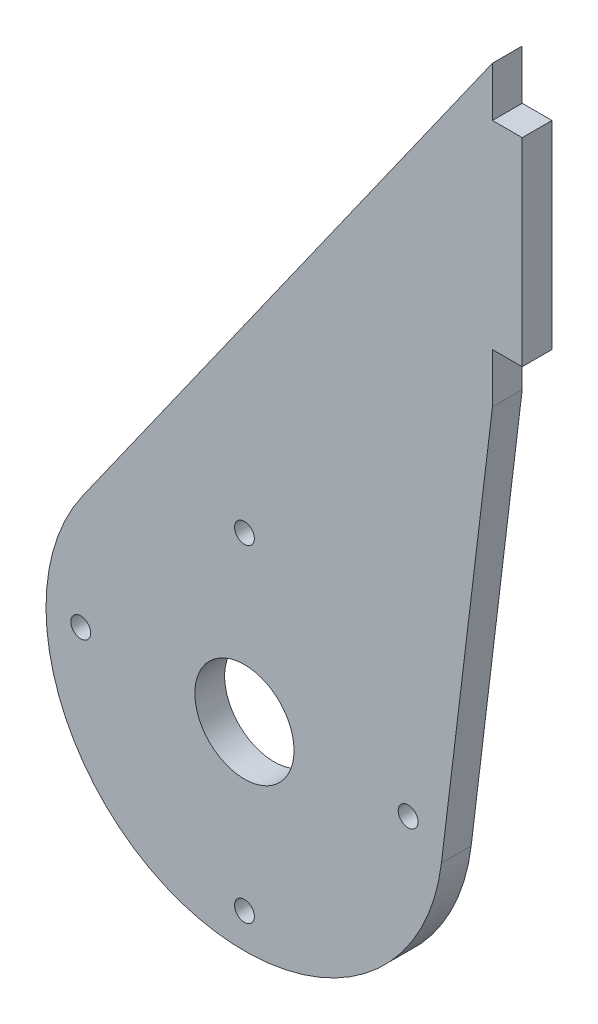
ISO-10303-21;
HEADER;
FILE_DESCRIPTION(('STEP AP214'),'2;1');
FILE_NAME('part.step','',(''),(''),'','','');
FILE_SCHEMA(('AUTOMOTIVE_DESIGN { 1 0 10303 214 1 1 1 1 }'));
ENDSEC;
DATA;
#1=APPLICATION_CONTEXT('core data for automotive mechanical design processes');
#2=APPLICATION_PROTOCOL_DEFINITION('international standard','automotive_design',2000,#1);
#3=PRODUCT_CONTEXT('',#1,'mechanical');
#4=PRODUCT('Part','Part','',(#3));
#5=PRODUCT_RELATED_PRODUCT_CATEGORY('part','',(#4));
#6=PRODUCT_DEFINITION_FORMATION('','',#4);
#7=PRODUCT_DEFINITION_CONTEXT('part definition',#1,'design');
#8=PRODUCT_DEFINITION('design','',#6,#7);
#9=PRODUCT_DEFINITION_SHAPE('','',#8);
#10=(LENGTH_UNIT() NAMED_UNIT(*) SI_UNIT(.MILLI.,.METRE.));
#11=(NAMED_UNIT(*) PLANE_ANGLE_UNIT() SI_UNIT($,.RADIAN.));
#12=(NAMED_UNIT(*) SI_UNIT($,.STERADIAN.) SOLID_ANGLE_UNIT());
#13=UNCERTAINTY_MEASURE_WITH_UNIT(LENGTH_MEASURE(1.E-05),#10,'distance_accuracy_value','');
#14=(GEOMETRIC_REPRESENTATION_CONTEXT(3) GLOBAL_UNCERTAINTY_ASSIGNED_CONTEXT((#13)) GLOBAL_UNIT_ASSIGNED_CONTEXT((#10,
#11,#12)) REPRESENTATION_CONTEXT('',''));
#15=CARTESIAN_POINT('',(0.,0.,0.));
#16=DIRECTION('',(0.,0.,1.));
#17=DIRECTION('',(1.,0.,0.));
#18=AXIS2_PLACEMENT_3D('',#15,#16,#17);
#19=CARTESIAN_POINT('',(25.,70.,-3.));
#20=DIRECTION('',(1.,0.,0.));
#21=DIRECTION('',(0.,1.,0.));
#22=AXIS2_PLACEMENT_3D('',#19,#20,#21);
#23=PLANE('',#22);
#24=DIRECTION('',(0.,0.,1.));
#25=VECTOR('',#24,1.);
#26=CARTESIAN_POINT('',(25.,65.,0.));
#27=LINE('',#26,#25);
#28=CARTESIAN_POINT('',(25.,65.,-3.));
#29=VERTEX_POINT('',#28);
#30=CARTESIAN_POINT('',(25.,65.,0.));
#31=VERTEX_POINT('',#30);
#32=EDGE_CURVE('E49',#29,#31,#27,.T.);
#33=ORIENTED_EDGE('',*,*,#32,.F.);
#34=DIRECTION('',(0.,1.,0.));
#35=VECTOR('',#34,1.);
#36=CARTESIAN_POINT('',(25.,70.,-3.));
#37=LINE('',#36,#35);
#38=CARTESIAN_POINT('',(25.,70.,-3.));
#39=VERTEX_POINT('',#38);
#40=EDGE_CURVE('E155',#29,#39,#37,.T.);
#41=ORIENTED_EDGE('',*,*,#40,.T.);
#42=DIRECTION('',(0.,0.,1.));
#43=VECTOR('',#42,1.);
#44=CARTESIAN_POINT('',(25.,70.,-3.));
#45=LINE('',#44,#43);
#46=CARTESIAN_POINT('',(25.,70.,0.));
#47=VERTEX_POINT('',#46);
#48=EDGE_CURVE('E41',#39,#47,#45,.T.);
#49=ORIENTED_EDGE('',*,*,#48,.T.);
#50=DIRECTION('',(0.,1.,0.));
#51=VECTOR('',#50,1.);
#52=CARTESIAN_POINT('',(25.,70.,0.));
#53=LINE('',#52,#51);
#54=EDGE_CURVE('E54',#31,#47,#53,.T.);
#55=ORIENTED_EDGE('',*,*,#54,.F.);
#56=EDGE_LOOP('',(#33,#41,#49,#55));
#57=FACE_BOUND('',#56,.T.);
#58=ADVANCED_FACE('F32',(#57),#23,.T.);
#59=CARTESIAN_POINT('',(0.,0.,-3.));
#60=DIRECTION('',(0.,0.,1.));
#61=DIRECTION('',(1.,0.,0.));
#62=AXIS2_PLACEMENT_3D('',#59,#60,#61);
#63=CYLINDRICAL_SURFACE('',#62,20.);
#64=CARTESIAN_POINT('',(0.,0.,0.));
#65=DIRECTION('',(0.,0.,1.));
#66=DIRECTION('',(1.,0.,0.));
#67=AXIS2_PLACEMENT_3D('',#64,#65,#66);
#68=CIRCLE('',#67,20.);
#69=CARTESIAN_POINT('',(-16.3302710303954,11.5465253679983,0.));
#70=VERTEX_POINT('',#69);
#71=CARTESIAN_POINT('',(19.854388755627,-2.40899297226689,0.));
#72=VERTEX_POINT('',#71);
#73=EDGE_CURVE('E147',#70,#72,#68,.T.);
#74=ORIENTED_EDGE('',*,*,#73,.F.);
#75=DIRECTION('',(0.,0.,1.));
#76=VECTOR('',#75,1.);
#77=CARTESIAN_POINT('',(-16.3302710303954,11.5465253679983,-3.));
#78=LINE('',#77,#76);
#79=CARTESIAN_POINT('',(-16.3302710303954,11.5465253679983,-3.));
#80=VERTEX_POINT('',#79);
#81=EDGE_CURVE('E11',#80,#70,#78,.T.);
#82=ORIENTED_EDGE('',*,*,#81,.F.);
#83=CARTESIAN_POINT('',(0.,0.,-3.));
#84=DIRECTION('',(0.,0.,1.));
#85=DIRECTION('',(1.,0.,0.));
#86=AXIS2_PLACEMENT_3D('',#83,#84,#85);
#87=CIRCLE('',#86,20.);
#88=CARTESIAN_POINT('',(19.854388755627,-2.40899297226689,-3.));
#89=VERTEX_POINT('',#88);
#90=EDGE_CURVE('E148',#80,#89,#87,.T.);
#91=ORIENTED_EDGE('',*,*,#90,.T.);
#92=DIRECTION('',(0.,0.,1.));
#93=VECTOR('',#92,1.);
#94=CARTESIAN_POINT('',(19.854388755627,-2.40899297226689,-3.));
#95=LINE('',#94,#93);
#96=EDGE_CURVE('E178',#89,#72,#95,.T.);
#97=ORIENTED_EDGE('',*,*,#96,.T.);
#98=EDGE_LOOP('',(#74,#82,#91,#97));
#99=FACE_BOUND('',#98,.T.);
#100=ADVANCED_FACE('F34',(#99),#63,.T.);
#101=CARTESIAN_POINT('',(-16.3302710303954,11.5465253679983,-3.));
#102=DIRECTION('',(-0.816513551519769,0.577326268399917,0.));
#103=DIRECTION('',(-0.577326268399917,-0.816513551519769,0.));
#104=AXIS2_PLACEMENT_3D('',#101,#102,#103);
#105=PLANE('',#104);
#106=DIRECTION('',(-0.577326268399917,-0.816513551519769,0.));
#107=VECTOR('',#106,1.);
#108=CARTESIAN_POINT('',(-16.3302710303954,11.5465253679983,0.));
#109=LINE('',#108,#107);
#110=EDGE_CURVE('E152',#47,#70,#109,.T.);
#111=ORIENTED_EDGE('',*,*,#110,.F.);
#112=ORIENTED_EDGE('',*,*,#48,.F.);
#113=DIRECTION('',(-0.577326268399917,-0.816513551519769,0.));
#114=VECTOR('',#113,1.);
#115=CARTESIAN_POINT('',(-16.3302710303954,11.5465253679983,-3.));
#116=LINE('',#115,#114);
#117=EDGE_CURVE('E158',#39,#80,#116,.T.);
#118=ORIENTED_EDGE('',*,*,#117,.T.);
#119=ORIENTED_EDGE('',*,*,#81,.T.);
#120=EDGE_LOOP('',(#111,#112,#118,#119));
#121=FACE_BOUND('',#120,.T.);
#122=ADVANCED_FACE('F187',(#121),#105,.T.);
#123=DIRECTION('',(0.,0.,-1.));
#124=VECTOR('',#123,1.);
#125=CARTESIAN_POINT('',(25.,45.,0.));
#126=LINE('',#125,#124);
#127=CARTESIAN_POINT('',(25.,45.,0.));
#128=VERTEX_POINT('',#127);
#129=CARTESIAN_POINT('',(25.,45.,-3.));
#130=VERTEX_POINT('',#129);
#131=EDGE_CURVE('E137',#128,#130,#126,.T.);
#132=ORIENTED_EDGE('',*,*,#131,.F.);
#133=CARTESIAN_POINT('',(25.,40.,0.));
#134=VERTEX_POINT('',#133);
#135=EDGE_CURVE('E122',#134,#128,#53,.T.);
#136=ORIENTED_EDGE('',*,*,#135,.F.);
#137=DIRECTION('',(0.,0.,1.));
#138=VECTOR('',#137,1.);
#139=CARTESIAN_POINT('',(25.,40.,-3.));
#140=LINE('',#139,#138);
#141=CARTESIAN_POINT('',(25.,40.,-3.));
#142=VERTEX_POINT('',#141);
#143=EDGE_CURVE('E177',#142,#134,#140,.T.);
#144=ORIENTED_EDGE('',*,*,#143,.F.);
#145=EDGE_CURVE('E164',#142,#130,#37,.T.);
#146=ORIENTED_EDGE('',*,*,#145,.T.);
#147=EDGE_LOOP('',(#132,#136,#144,#146));
#148=FACE_BOUND('',#147,.T.);
#149=ADVANCED_FACE('F197',(#148),#23,.T.);
#150=CARTESIAN_POINT('',(25.,40.,-3.));
#151=DIRECTION('',(0.992719437781351,-0.120449648613344,0.));
#152=DIRECTION('',(0.120449648613344,0.992719437781351,0.));
#153=AXIS2_PLACEMENT_3D('',#150,#151,#152);
#154=PLANE('',#153);
#155=DIRECTION('',(0.120449648613344,0.992719437781351,0.));
#156=VECTOR('',#155,1.);
#157=CARTESIAN_POINT('',(25.,40.,0.));
#158=LINE('',#157,#156);
#159=EDGE_CURVE('E168',#72,#134,#158,.T.);
#160=ORIENTED_EDGE('',*,*,#159,.F.);
#161=ORIENTED_EDGE('',*,*,#96,.F.);
#162=DIRECTION('',(0.120449648613344,0.992719437781351,0.));
#163=VECTOR('',#162,1.);
#164=CARTESIAN_POINT('',(25.,40.,-3.));
#165=LINE('',#164,#163);
#166=EDGE_CURVE('E151',#89,#142,#165,.T.);
#167=ORIENTED_EDGE('',*,*,#166,.T.);
#168=ORIENTED_EDGE('',*,*,#143,.T.);
#169=EDGE_LOOP('',(#160,#161,#167,#168));
#170=FACE_BOUND('',#169,.T.);
#171=ADVANCED_FACE('F203',(#170),#154,.T.);
#172=CARTESIAN_POINT('',(0.,0.,-3.));
#173=DIRECTION('',(0.,0.,1.));
#174=DIRECTION('',(1.,0.,0.));
#175=AXIS2_PLACEMENT_3D('',#172,#173,#174);
#176=PLANE('',#175);
#177=CARTESIAN_POINT('',(-16.5,0.,-3.));
#178=DIRECTION('',(0.,0.,1.));
#179=DIRECTION('',(1.,0.,0.));
#180=AXIS2_PLACEMENT_3D('',#177,#178,#179);
#181=CIRCLE('',#180,1.);
#182=CARTESIAN_POINT('',(-15.5,0.,-3.));
#183=VERTEX_POINT('',#182);
#184=EDGE_CURVE('E286',#183,#183,#181,.T.);
#185=ORIENTED_EDGE('',*,*,#184,.T.);
#186=EDGE_LOOP('',(#185));
#187=FACE_BOUND('',#186,.T.);
#188=CARTESIAN_POINT('',(16.5,0.,-3.));
#189=DIRECTION('',(0.,0.,1.));
#190=DIRECTION('',(1.,0.,0.));
#191=AXIS2_PLACEMENT_3D('',#188,#189,#190);
#192=CIRCLE('',#191,1.);
#193=CARTESIAN_POINT('',(17.5,0.,-3.));
#194=VERTEX_POINT('',#193);
#195=EDGE_CURVE('E288',#194,#194,#192,.T.);
#196=ORIENTED_EDGE('',*,*,#195,.T.);
#197=EDGE_LOOP('',(#196));
#198=FACE_BOUND('',#197,.T.);
#199=CARTESIAN_POINT('',(0.,-16.5,-3.));
#200=DIRECTION('',(0.,0.,1.));
#201=DIRECTION('',(1.,0.,0.));
#202=AXIS2_PLACEMENT_3D('',#199,#200,#201);
#203=CIRCLE('',#202,1.);
#204=CARTESIAN_POINT('',(1.,-16.5,-3.));
#205=VERTEX_POINT('',#204);
#206=EDGE_CURVE('E217',#205,#205,#203,.T.);
#207=ORIENTED_EDGE('',*,*,#206,.T.);
#208=EDGE_LOOP('',(#207));
#209=FACE_BOUND('',#208,.T.);
#210=CARTESIAN_POINT('',(0.,16.5,-3.));
#211=DIRECTION('',(0.,0.,1.));
#212=DIRECTION('',(1.,0.,0.));
#213=AXIS2_PLACEMENT_3D('',#210,#211,#212);
#214=CIRCLE('',#213,1.);
#215=CARTESIAN_POINT('',(1.,16.5,-3.));
#216=VERTEX_POINT('',#215);
#217=EDGE_CURVE('E210',#216,#216,#214,.T.);
#218=ORIENTED_EDGE('',*,*,#217,.T.);
#219=EDGE_LOOP('',(#218));
#220=FACE_BOUND('',#219,.T.);
#221=CARTESIAN_POINT('',(0.,0.,-3.));
#222=DIRECTION('',(0.,0.,1.));
#223=DIRECTION('',(1.,0.,0.));
#224=AXIS2_PLACEMENT_3D('',#221,#222,#223);
#225=CIRCLE('',#224,5.);
#226=CARTESIAN_POINT('',(5.,0.,-3.));
#227=VERTEX_POINT('',#226);
#228=EDGE_CURVE('E126',#227,#227,#225,.T.);
#229=ORIENTED_EDGE('',*,*,#228,.T.);
#230=EDGE_LOOP('',(#229));
#231=FACE_BOUND('',#230,.T.);
#232=ORIENTED_EDGE('',*,*,#90,.F.);
#233=ORIENTED_EDGE('',*,*,#117,.F.);
#234=ORIENTED_EDGE('',*,*,#40,.F.);
#235=DIRECTION('',(-1.,0.,0.));
#236=VECTOR('',#235,1.);
#237=CARTESIAN_POINT('',(28.,65.,-3.));
#238=LINE('',#237,#236);
#239=CARTESIAN_POINT('',(28.,65.,-3.));
#240=VERTEX_POINT('',#239);
#241=EDGE_CURVE('E128',#240,#29,#238,.T.);
#242=ORIENTED_EDGE('',*,*,#241,.F.);
#243=DIRECTION('',(0.,1.,0.));
#244=VECTOR('',#243,1.);
#245=CARTESIAN_POINT('',(28.,65.,-3.));
#246=LINE('',#245,#244);
#247=CARTESIAN_POINT('',(28.,45.,-3.));
#248=VERTEX_POINT('',#247);
#249=EDGE_CURVE('E106',#248,#240,#246,.T.);
#250=ORIENTED_EDGE('',*,*,#249,.F.);
#251=DIRECTION('',(-1.,0.,0.));
#252=VECTOR('',#251,1.);
#253=CARTESIAN_POINT('',(28.,45.,-3.));
#254=LINE('',#253,#252);
#255=EDGE_CURVE('E103',#248,#130,#254,.T.);
#256=ORIENTED_EDGE('',*,*,#255,.T.);
#257=ORIENTED_EDGE('',*,*,#145,.F.);
#258=ORIENTED_EDGE('',*,*,#166,.F.);
#259=EDGE_LOOP('',(#232,#233,#234,#242,#250,#256,#257,#258));
#260=FACE_BOUND('',#259,.T.);
#261=ADVANCED_FACE('F190',(#187,#198,#209,#220,#231,#260),#176,.F.);
#262=CARTESIAN_POINT('',(0.,0.,0.));
#263=DIRECTION('',(0.,0.,1.));
#264=DIRECTION('',(1.,0.,0.));
#265=AXIS2_PLACEMENT_3D('',#262,#263,#264);
#266=PLANE('',#265);
#267=CARTESIAN_POINT('',(-16.5,0.,0.));
#268=DIRECTION('',(0.,0.,1.));
#269=DIRECTION('',(1.,0.,0.));
#270=AXIS2_PLACEMENT_3D('',#267,#268,#269);
#271=CIRCLE('',#270,1.);
#272=CARTESIAN_POINT('',(-15.5,0.,0.));
#273=VERTEX_POINT('',#272);
#274=EDGE_CURVE('E249',#273,#273,#271,.T.);
#275=ORIENTED_EDGE('',*,*,#274,.F.);
#276=EDGE_LOOP('',(#275));
#277=FACE_BOUND('',#276,.T.);
#278=CARTESIAN_POINT('',(16.5,0.,0.));
#279=DIRECTION('',(0.,0.,1.));
#280=DIRECTION('',(1.,0.,0.));
#281=AXIS2_PLACEMENT_3D('',#278,#279,#280);
#282=CIRCLE('',#281,1.);
#283=CARTESIAN_POINT('',(17.5,0.,0.));
#284=VERTEX_POINT('',#283);
#285=EDGE_CURVE('E253',#284,#284,#282,.T.);
#286=ORIENTED_EDGE('',*,*,#285,.F.);
#287=EDGE_LOOP('',(#286));
#288=FACE_BOUND('',#287,.T.);
#289=CARTESIAN_POINT('',(0.,-16.5,0.));
#290=DIRECTION('',(0.,0.,1.));
#291=DIRECTION('',(1.,0.,0.));
#292=AXIS2_PLACEMENT_3D('',#289,#290,#291);
#293=CIRCLE('',#292,1.);
#294=CARTESIAN_POINT('',(1.,-16.5,0.));
#295=VERTEX_POINT('',#294);
#296=EDGE_CURVE('E257',#295,#295,#293,.T.);
#297=ORIENTED_EDGE('',*,*,#296,.F.);
#298=EDGE_LOOP('',(#297));
#299=FACE_BOUND('',#298,.T.);
#300=CARTESIAN_POINT('',(0.,16.5,0.));
#301=DIRECTION('',(0.,0.,1.));
#302=DIRECTION('',(1.,0.,0.));
#303=AXIS2_PLACEMENT_3D('',#300,#301,#302);
#304=CIRCLE('',#303,1.);
#305=CARTESIAN_POINT('',(1.,16.5,0.));
#306=VERTEX_POINT('',#305);
#307=EDGE_CURVE('E212',#306,#306,#304,.T.);
#308=ORIENTED_EDGE('',*,*,#307,.F.);
#309=EDGE_LOOP('',(#308));
#310=FACE_BOUND('',#309,.T.);
#311=CARTESIAN_POINT('',(0.,0.,0.));
#312=DIRECTION('',(0.,0.,1.));
#313=DIRECTION('',(1.,0.,0.));
#314=AXIS2_PLACEMENT_3D('',#311,#312,#313);
#315=CIRCLE('',#314,5.);
#316=CARTESIAN_POINT('',(5.,0.,0.));
#317=VERTEX_POINT('',#316);
#318=EDGE_CURVE('E123',#317,#317,#315,.T.);
#319=ORIENTED_EDGE('',*,*,#318,.F.);
#320=EDGE_LOOP('',(#319));
#321=FACE_BOUND('',#320,.T.);
#322=ORIENTED_EDGE('',*,*,#73,.T.);
#323=ORIENTED_EDGE('',*,*,#159,.T.);
#324=ORIENTED_EDGE('',*,*,#135,.T.);
#325=DIRECTION('',(-1.,0.,0.));
#326=VECTOR('',#325,1.);
#327=CARTESIAN_POINT('',(28.,45.,0.));
#328=LINE('',#327,#326);
#329=CARTESIAN_POINT('',(28.,45.,0.));
#330=VERTEX_POINT('',#329);
#331=EDGE_CURVE('E101',#330,#128,#328,.T.);
#332=ORIENTED_EDGE('',*,*,#331,.F.);
#333=DIRECTION('',(0.,-1.,0.));
#334=VECTOR('',#333,1.);
#335=CARTESIAN_POINT('',(28.,65.,0.));
#336=LINE('',#335,#334);
#337=CARTESIAN_POINT('',(28.,65.,0.));
#338=VERTEX_POINT('',#337);
#339=EDGE_CURVE('E107',#338,#330,#336,.T.);
#340=ORIENTED_EDGE('',*,*,#339,.F.);
#341=DIRECTION('',(-1.,0.,0.));
#342=VECTOR('',#341,1.);
#343=CARTESIAN_POINT('',(28.,65.,0.));
#344=LINE('',#343,#342);
#345=EDGE_CURVE('E138',#338,#31,#344,.T.);
#346=ORIENTED_EDGE('',*,*,#345,.T.);
#347=ORIENTED_EDGE('',*,*,#54,.T.);
#348=ORIENTED_EDGE('',*,*,#110,.T.);
#349=EDGE_LOOP('',(#322,#323,#324,#332,#340,#346,#347,#348));
#350=FACE_BOUND('',#349,.T.);
#351=ADVANCED_FACE('F119',(#277,#288,#299,#310,#321,#350),#266,.T.);
#352=CARTESIAN_POINT('',(0.,0.,-10.));
#353=DIRECTION('',(0.,0.,1.));
#354=DIRECTION('',(1.,0.,0.));
#355=AXIS2_PLACEMENT_3D('',#352,#353,#354);
#356=CYLINDRICAL_SURFACE('',#355,5.);
#357=ORIENTED_EDGE('',*,*,#318,.T.);
#358=EDGE_LOOP('',(#357));
#359=FACE_BOUND('',#358,.T.);
#360=ORIENTED_EDGE('',*,*,#228,.F.);
#361=EDGE_LOOP('',(#360));
#362=FACE_BOUND('',#361,.T.);
#363=ADVANCED_FACE('F232',(#359,#362),#356,.F.);
#364=CARTESIAN_POINT('',(28.,45.,0.));
#365=DIRECTION('',(0.,1.,0.));
#366=DIRECTION('',(-1.,0.,0.));
#367=AXIS2_PLACEMENT_3D('',#364,#365,#366);
#368=PLANE('',#367);
#369=ORIENTED_EDGE('',*,*,#131,.T.);
#370=ORIENTED_EDGE('',*,*,#255,.F.);
#371=DIRECTION('',(0.,0.,-1.));
#372=VECTOR('',#371,1.);
#373=CARTESIAN_POINT('',(28.,45.,0.));
#374=LINE('',#373,#372);
#375=EDGE_CURVE('E96',#330,#248,#374,.T.);
#376=ORIENTED_EDGE('',*,*,#375,.F.);
#377=ORIENTED_EDGE('',*,*,#331,.T.);
#378=EDGE_LOOP('',(#369,#370,#376,#377));
#379=FACE_BOUND('',#378,.T.);
#380=ADVANCED_FACE('F99',(#379),#368,.F.);
#381=CARTESIAN_POINT('',(28.,65.,0.));
#382=DIRECTION('',(0.,-1.,0.));
#383=DIRECTION('',(1.,0.,0.));
#384=AXIS2_PLACEMENT_3D('',#381,#382,#383);
#385=PLANE('',#384);
#386=ORIENTED_EDGE('',*,*,#32,.T.);
#387=ORIENTED_EDGE('',*,*,#345,.F.);
#388=DIRECTION('',(0.,0.,1.));
#389=VECTOR('',#388,1.);
#390=CARTESIAN_POINT('',(28.,65.,0.));
#391=LINE('',#390,#389);
#392=EDGE_CURVE('E112',#240,#338,#391,.T.);
#393=ORIENTED_EDGE('',*,*,#392,.F.);
#394=ORIENTED_EDGE('',*,*,#241,.T.);
#395=EDGE_LOOP('',(#386,#387,#393,#394));
#396=FACE_BOUND('',#395,.T.);
#397=ADVANCED_FACE('F223',(#396),#385,.F.);
#398=CARTESIAN_POINT('',(28.,0.,0.));
#399=DIRECTION('',(1.,0.,0.));
#400=DIRECTION('',(0.,1.,0.));
#401=AXIS2_PLACEMENT_3D('',#398,#399,#400);
#402=PLANE('',#401);
#403=ORIENTED_EDGE('',*,*,#339,.T.);
#404=ORIENTED_EDGE('',*,*,#375,.T.);
#405=ORIENTED_EDGE('',*,*,#249,.T.);
#406=ORIENTED_EDGE('',*,*,#392,.T.);
#407=EDGE_LOOP('',(#403,#404,#405,#406));
#408=FACE_BOUND('',#407,.T.);
#409=ADVANCED_FACE('F110',(#408),#402,.T.);
#410=CARTESIAN_POINT('',(0.,16.5,-10.));
#411=DIRECTION('',(0.,0.,1.));
#412=DIRECTION('',(1.,0.,0.));
#413=AXIS2_PLACEMENT_3D('',#410,#411,#412);
#414=CYLINDRICAL_SURFACE('',#413,1.);
#415=ORIENTED_EDGE('',*,*,#307,.T.);
#416=EDGE_LOOP('',(#415));
#417=FACE_BOUND('',#416,.T.);
#418=ORIENTED_EDGE('',*,*,#217,.F.);
#419=EDGE_LOOP('',(#418));
#420=FACE_BOUND('',#419,.T.);
#421=ADVANCED_FACE('F230',(#417,#420),#414,.F.);
#422=CARTESIAN_POINT('',(0.,-16.5,-10.));
#423=DIRECTION('',(0.,0.,1.));
#424=DIRECTION('',(1.,0.,0.));
#425=AXIS2_PLACEMENT_3D('',#422,#423,#424);
#426=CYLINDRICAL_SURFACE('',#425,1.);
#427=ORIENTED_EDGE('',*,*,#296,.T.);
#428=EDGE_LOOP('',(#427));
#429=FACE_BOUND('',#428,.T.);
#430=ORIENTED_EDGE('',*,*,#206,.F.);
#431=EDGE_LOOP('',(#430));
#432=FACE_BOUND('',#431,.T.);
#433=ADVANCED_FACE('F267',(#429,#432),#426,.F.);
#434=CARTESIAN_POINT('',(16.5,0.,-10.));
#435=DIRECTION('',(0.,0.,1.));
#436=DIRECTION('',(1.,0.,0.));
#437=AXIS2_PLACEMENT_3D('',#434,#435,#436);
#438=CYLINDRICAL_SURFACE('',#437,1.);
#439=ORIENTED_EDGE('',*,*,#285,.T.);
#440=EDGE_LOOP('',(#439));
#441=FACE_BOUND('',#440,.T.);
#442=ORIENTED_EDGE('',*,*,#195,.F.);
#443=EDGE_LOOP('',(#442));
#444=FACE_BOUND('',#443,.T.);
#445=ADVANCED_FACE('F271',(#441,#444),#438,.F.);
#446=CARTESIAN_POINT('',(-16.5,0.,-10.));
#447=DIRECTION('',(0.,0.,1.));
#448=DIRECTION('',(1.,0.,0.));
#449=AXIS2_PLACEMENT_3D('',#446,#447,#448);
#450=CYLINDRICAL_SURFACE('',#449,1.);
#451=ORIENTED_EDGE('',*,*,#274,.T.);
#452=EDGE_LOOP('',(#451));
#453=FACE_BOUND('',#452,.T.);
#454=ORIENTED_EDGE('',*,*,#184,.F.);
#455=EDGE_LOOP('',(#454));
#456=FACE_BOUND('',#455,.T.);
#457=ADVANCED_FACE('F277',(#453,#456),#450,.F.);
#458=CLOSED_SHELL('',(#58,#100,#122,#149,#171,#261,#351,#363,#380,#397,#409,#421,#433,#445,#457));
#459=MANIFOLD_SOLID_BREP('B2',#458);
#460=ADVANCED_BREP_SHAPE_REPRESENTATION('',(#18,#459),#14);
#461=SHAPE_DEFINITION_REPRESENTATION(#9,#460);
ENDSEC;
END-ISO-10303-21;
